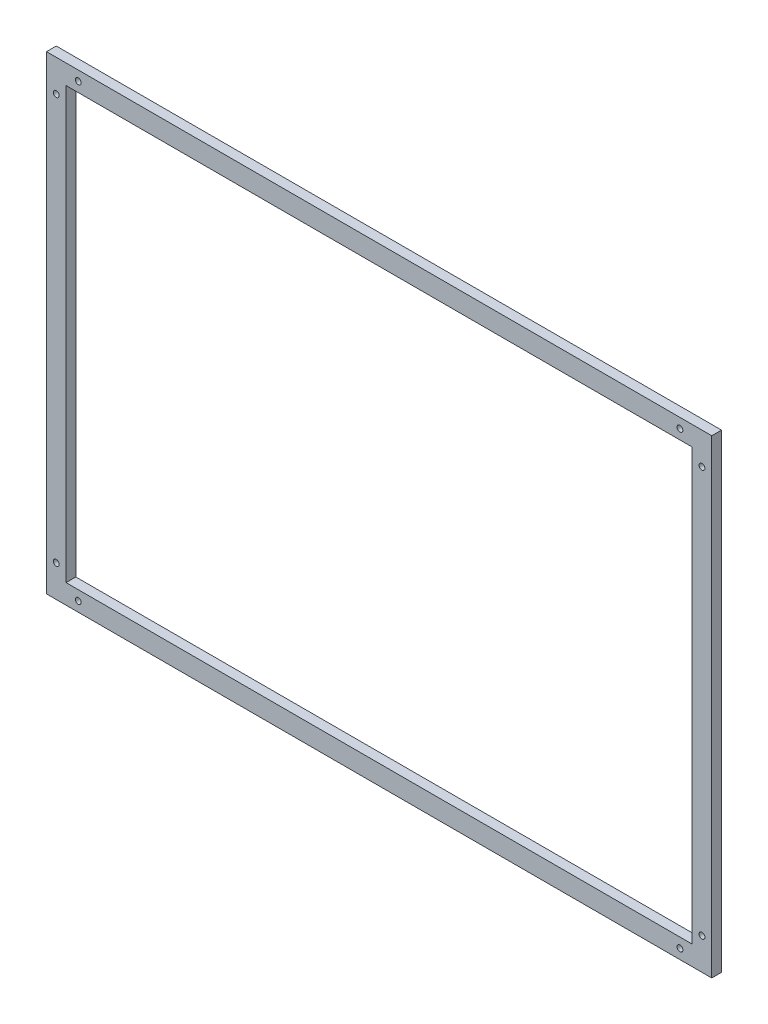
ISO-10303-21;
HEADER;
FILE_DESCRIPTION(('STEP AP214'),'2;1');
FILE_NAME('part.step','',(''),(''),'','','');
FILE_SCHEMA(('AUTOMOTIVE_DESIGN { 1 0 10303 214 1 1 1 1 }'));
ENDSEC;
DATA;
#1=APPLICATION_CONTEXT('core data for automotive mechanical design processes');
#2=APPLICATION_PROTOCOL_DEFINITION('international standard','automotive_design',2000,#1);
#3=PRODUCT_CONTEXT('',#1,'mechanical');
#4=PRODUCT('Part','Part','',(#3));
#5=PRODUCT_RELATED_PRODUCT_CATEGORY('part','',(#4));
#6=PRODUCT_DEFINITION_FORMATION('','',#4);
#7=PRODUCT_DEFINITION_CONTEXT('part definition',#1,'design');
#8=PRODUCT_DEFINITION('design','',#6,#7);
#9=PRODUCT_DEFINITION_SHAPE('','',#8);
#10=(LENGTH_UNIT() NAMED_UNIT(*) SI_UNIT(.MILLI.,.METRE.));
#11=(NAMED_UNIT(*) PLANE_ANGLE_UNIT() SI_UNIT($,.RADIAN.));
#12=(NAMED_UNIT(*) SI_UNIT($,.STERADIAN.) SOLID_ANGLE_UNIT());
#13=UNCERTAINTY_MEASURE_WITH_UNIT(LENGTH_MEASURE(1.E-05),#10,'distance_accuracy_value','');
#14=(GEOMETRIC_REPRESENTATION_CONTEXT(3) GLOBAL_UNCERTAINTY_ASSIGNED_CONTEXT((#13)) GLOBAL_UNIT_ASSIGNED_CONTEXT((#10,
#11,#12)) REPRESENTATION_CONTEXT('',''));
#15=CARTESIAN_POINT('',(0.,0.,0.));
#16=DIRECTION('',(0.,0.,1.));
#17=DIRECTION('',(1.,0.,0.));
#18=AXIS2_PLACEMENT_3D('',#15,#16,#17);
#19=CARTESIAN_POINT('',(0.,0.,10.));
#20=DIRECTION('',(0.,0.,1.));
#21=DIRECTION('',(1.,0.,0.));
#22=AXIS2_PLACEMENT_3D('',#19,#20,#21);
#23=PLANE('',#22);
#24=CARTESIAN_POINT('',(-10.,32.5,10.));
#25=DIRECTION('',(0.,0.,1.));
#26=DIRECTION('',(1.,0.,0.));
#27=AXIS2_PLACEMENT_3D('',#24,#25,#26);
#28=CIRCLE('',#27,3.);
#29=CARTESIAN_POINT('',(-7.,32.5,10.));
#30=VERTEX_POINT('',#29);
#31=EDGE_CURVE('E255',#30,#30,#28,.T.);
#32=ORIENTED_EDGE('',*,*,#31,.F.);
#33=EDGE_LOOP('',(#32));
#34=FACE_BOUND('',#33,.T.);
#35=CARTESIAN_POINT('',(-32.5,9.99999999999992,10.));
#36=DIRECTION('',(0.,0.,1.));
#37=DIRECTION('',(1.,0.,0.));
#38=AXIS2_PLACEMENT_3D('',#35,#36,#37);
#39=CIRCLE('',#38,3.);
#40=CARTESIAN_POINT('',(-29.5,9.99999999999992,10.));
#41=VERTEX_POINT('',#40);
#42=EDGE_CURVE('E257',#41,#41,#39,.T.);
#43=ORIENTED_EDGE('',*,*,#42,.F.);
#44=EDGE_LOOP('',(#43));
#45=FACE_BOUND('',#44,.T.);
#46=CARTESIAN_POINT('',(-647.5,9.9999999999999,10.));
#47=DIRECTION('',(0.,0.,1.));
#48=DIRECTION('',(1.,0.,0.));
#49=AXIS2_PLACEMENT_3D('',#46,#47,#48);
#50=CIRCLE('',#49,3.00000000000005);
#51=CARTESIAN_POINT('',(-644.5,9.9999999999999,10.));
#52=VERTEX_POINT('',#51);
#53=EDGE_CURVE('E263',#52,#52,#50,.T.);
#54=ORIENTED_EDGE('',*,*,#53,.F.);
#55=EDGE_LOOP('',(#54));
#56=FACE_BOUND('',#55,.T.);
#57=CARTESIAN_POINT('',(-670.,32.5,10.));
#58=DIRECTION('',(0.,0.,1.));
#59=DIRECTION('',(1.,0.,0.));
#60=AXIS2_PLACEMENT_3D('',#57,#58,#59);
#61=CIRCLE('',#60,3.00000000000005);
#62=CARTESIAN_POINT('',(-667.,32.5,10.));
#63=VERTEX_POINT('',#62);
#64=EDGE_CURVE('E269',#63,#63,#61,.T.);
#65=ORIENTED_EDGE('',*,*,#64,.F.);
#66=EDGE_LOOP('',(#65));
#67=FACE_BOUND('',#66,.T.);
#68=CARTESIAN_POINT('',(-670.,447.5,10.));
#69=DIRECTION('',(0.,0.,1.));
#70=DIRECTION('',(1.,0.,0.));
#71=AXIS2_PLACEMENT_3D('',#68,#69,#70);
#72=CIRCLE('',#71,3.00000000000005);
#73=CARTESIAN_POINT('',(-667.,447.5,10.));
#74=VERTEX_POINT('',#73);
#75=EDGE_CURVE('E275',#74,#74,#72,.T.);
#76=ORIENTED_EDGE('',*,*,#75,.F.);
#77=EDGE_LOOP('',(#76));
#78=FACE_BOUND('',#77,.T.);
#79=CARTESIAN_POINT('',(-647.5,470.,10.));
#80=DIRECTION('',(0.,0.,1.));
#81=DIRECTION('',(1.,0.,0.));
#82=AXIS2_PLACEMENT_3D('',#79,#80,#81);
#83=CIRCLE('',#82,3.00000000000005);
#84=CARTESIAN_POINT('',(-644.5,470.,10.));
#85=VERTEX_POINT('',#84);
#86=EDGE_CURVE('E281',#85,#85,#83,.T.);
#87=ORIENTED_EDGE('',*,*,#86,.F.);
#88=EDGE_LOOP('',(#87));
#89=FACE_BOUND('',#88,.T.);
#90=CARTESIAN_POINT('',(-10.,447.5,10.));
#91=DIRECTION('',(0.,0.,1.));
#92=DIRECTION('',(1.,0.,0.));
#93=AXIS2_PLACEMENT_3D('',#90,#91,#92);
#94=CIRCLE('',#93,3.);
#95=CARTESIAN_POINT('',(-7.,447.5,10.));
#96=VERTEX_POINT('',#95);
#97=EDGE_CURVE('E287',#96,#96,#94,.T.);
#98=ORIENTED_EDGE('',*,*,#97,.F.);
#99=EDGE_LOOP('',(#98));
#100=FACE_BOUND('',#99,.T.);
#101=CARTESIAN_POINT('',(-32.5,470.,10.));
#102=DIRECTION('',(0.,0.,1.));
#103=DIRECTION('',(1.,0.,0.));
#104=AXIS2_PLACEMENT_3D('',#101,#102,#103);
#105=CIRCLE('',#104,3.);
#106=CARTESIAN_POINT('',(-29.5,470.,10.));
#107=VERTEX_POINT('',#106);
#108=EDGE_CURVE('E293',#107,#107,#105,.T.);
#109=ORIENTED_EDGE('',*,*,#108,.F.);
#110=EDGE_LOOP('',(#109));
#111=FACE_BOUND('',#110,.T.);
#112=DIRECTION('',(0.,1.,0.));
#113=VECTOR('',#112,1.);
#114=CARTESIAN_POINT('',(0.,0.,10.));
#115=LINE('',#114,#113);
#116=CARTESIAN_POINT('',(0.,0.,10.));
#117=VERTEX_POINT('',#116);
#118=CARTESIAN_POINT('',(0.,480.,10.));
#119=VERTEX_POINT('',#118);
#120=EDGE_CURVE('E136',#117,#119,#115,.T.);
#121=ORIENTED_EDGE('',*,*,#120,.T.);
#122=DIRECTION('',(-1.,0.,0.));
#123=VECTOR('',#122,1.);
#124=CARTESIAN_POINT('',(0.,480.,10.));
#125=LINE('',#124,#123);
#126=CARTESIAN_POINT('',(-680.,480.,10.));
#127=VERTEX_POINT('',#126);
#128=EDGE_CURVE('E139',#119,#127,#125,.T.);
#129=ORIENTED_EDGE('',*,*,#128,.T.);
#130=DIRECTION('',(0.,-1.,0.));
#131=VECTOR('',#130,1.);
#132=CARTESIAN_POINT('',(-680.,0.,10.));
#133=LINE('',#132,#131);
#134=CARTESIAN_POINT('',(-680.,0.,10.));
#135=VERTEX_POINT('',#134);
#136=EDGE_CURVE('E142',#127,#135,#133,.T.);
#137=ORIENTED_EDGE('',*,*,#136,.T.);
#138=DIRECTION('',(1.,0.,0.));
#139=VECTOR('',#138,1.);
#140=CARTESIAN_POINT('',(0.,0.,10.));
#141=LINE('',#140,#139);
#142=EDGE_CURVE('E144',#135,#117,#141,.T.);
#143=ORIENTED_EDGE('',*,*,#142,.T.);
#144=EDGE_LOOP('',(#121,#129,#137,#143));
#145=FACE_BOUND('',#144,.T.);
#146=DIRECTION('',(1.,0.,0.));
#147=VECTOR('',#146,1.);
#148=CARTESIAN_POINT('',(-660.,19.9999999999999,10.));
#149=LINE('',#148,#147);
#150=CARTESIAN_POINT('',(-660.,19.9999999999999,10.));
#151=VERTEX_POINT('',#150);
#152=CARTESIAN_POINT('',(-20.,19.9999999999999,10.));
#153=VERTEX_POINT('',#152);
#154=EDGE_CURVE('E106',#151,#153,#149,.T.);
#155=ORIENTED_EDGE('',*,*,#154,.F.);
#156=DIRECTION('',(0.,-1.,0.));
#157=VECTOR('',#156,1.);
#158=CARTESIAN_POINT('',(-660.,460.,10.));
#159=LINE('',#158,#157);
#160=CARTESIAN_POINT('',(-660.,460.,10.));
#161=VERTEX_POINT('',#160);
#162=EDGE_CURVE('E98',#161,#151,#159,.T.);
#163=ORIENTED_EDGE('',*,*,#162,.F.);
#164=DIRECTION('',(-1.,0.,0.));
#165=VECTOR('',#164,1.);
#166=CARTESIAN_POINT('',(-660.,460.,10.));
#167=LINE('',#166,#165);
#168=CARTESIAN_POINT('',(-20.,460.,10.));
#169=VERTEX_POINT('',#168);
#170=EDGE_CURVE('E120',#169,#161,#167,.T.);
#171=ORIENTED_EDGE('',*,*,#170,.F.);
#172=DIRECTION('',(0.,1.,0.));
#173=VECTOR('',#172,1.);
#174=CARTESIAN_POINT('',(-20.,460.,10.));
#175=LINE('',#174,#173);
#176=EDGE_CURVE('E118',#153,#169,#175,.T.);
#177=ORIENTED_EDGE('',*,*,#176,.F.);
#178=EDGE_LOOP('',(#155,#163,#171,#177));
#179=FACE_BOUND('',#178,.T.);
#180=ADVANCED_FACE('F33',(#34,#45,#56,#67,#78,#89,#100,#111,#145,#179),#23,.T.);
#181=CARTESIAN_POINT('',(0.,0.,0.));
#182=DIRECTION('',(0.,0.,1.));
#183=DIRECTION('',(1.,0.,0.));
#184=AXIS2_PLACEMENT_3D('',#181,#182,#183);
#185=PLANE('',#184);
#186=CARTESIAN_POINT('',(-10.,32.5,0.));
#187=DIRECTION('',(0.,0.,1.));
#188=DIRECTION('',(1.,0.,0.));
#189=AXIS2_PLACEMENT_3D('',#186,#187,#188);
#190=CIRCLE('',#189,3.);
#191=CARTESIAN_POINT('',(-7.,32.5,0.));
#192=VERTEX_POINT('',#191);
#193=EDGE_CURVE('E253',#192,#192,#190,.T.);
#194=ORIENTED_EDGE('',*,*,#193,.T.);
#195=EDGE_LOOP('',(#194));
#196=FACE_BOUND('',#195,.T.);
#197=CARTESIAN_POINT('',(-32.5,9.99999999999992,0.));
#198=DIRECTION('',(0.,0.,1.));
#199=DIRECTION('',(1.,0.,0.));
#200=AXIS2_PLACEMENT_3D('',#197,#198,#199);
#201=CIRCLE('',#200,3.);
#202=CARTESIAN_POINT('',(-29.5,9.99999999999992,0.));
#203=VERTEX_POINT('',#202);
#204=EDGE_CURVE('E260',#203,#203,#201,.T.);
#205=ORIENTED_EDGE('',*,*,#204,.T.);
#206=EDGE_LOOP('',(#205));
#207=FACE_BOUND('',#206,.T.);
#208=CARTESIAN_POINT('',(-647.5,9.9999999999999,0.));
#209=DIRECTION('',(0.,0.,1.));
#210=DIRECTION('',(1.,0.,0.));
#211=AXIS2_PLACEMENT_3D('',#208,#209,#210);
#212=CIRCLE('',#211,3.00000000000005);
#213=CARTESIAN_POINT('',(-644.5,9.9999999999999,0.));
#214=VERTEX_POINT('',#213);
#215=EDGE_CURVE('E266',#214,#214,#212,.T.);
#216=ORIENTED_EDGE('',*,*,#215,.T.);
#217=EDGE_LOOP('',(#216));
#218=FACE_BOUND('',#217,.T.);
#219=CARTESIAN_POINT('',(-670.,32.5,0.));
#220=DIRECTION('',(0.,0.,1.));
#221=DIRECTION('',(1.,0.,0.));
#222=AXIS2_PLACEMENT_3D('',#219,#220,#221);
#223=CIRCLE('',#222,3.00000000000005);
#224=CARTESIAN_POINT('',(-667.,32.5,0.));
#225=VERTEX_POINT('',#224);
#226=EDGE_CURVE('E272',#225,#225,#223,.T.);
#227=ORIENTED_EDGE('',*,*,#226,.T.);
#228=EDGE_LOOP('',(#227));
#229=FACE_BOUND('',#228,.T.);
#230=CARTESIAN_POINT('',(-670.,447.5,0.));
#231=DIRECTION('',(0.,0.,1.));
#232=DIRECTION('',(1.,0.,0.));
#233=AXIS2_PLACEMENT_3D('',#230,#231,#232);
#234=CIRCLE('',#233,3.00000000000005);
#235=CARTESIAN_POINT('',(-667.,447.5,0.));
#236=VERTEX_POINT('',#235);
#237=EDGE_CURVE('E278',#236,#236,#234,.T.);
#238=ORIENTED_EDGE('',*,*,#237,.T.);
#239=EDGE_LOOP('',(#238));
#240=FACE_BOUND('',#239,.T.);
#241=CARTESIAN_POINT('',(-647.5,470.,0.));
#242=DIRECTION('',(0.,0.,1.));
#243=DIRECTION('',(1.,0.,0.));
#244=AXIS2_PLACEMENT_3D('',#241,#242,#243);
#245=CIRCLE('',#244,3.00000000000005);
#246=CARTESIAN_POINT('',(-644.5,470.,0.));
#247=VERTEX_POINT('',#246);
#248=EDGE_CURVE('E284',#247,#247,#245,.T.);
#249=ORIENTED_EDGE('',*,*,#248,.T.);
#250=EDGE_LOOP('',(#249));
#251=FACE_BOUND('',#250,.T.);
#252=CARTESIAN_POINT('',(-10.,447.5,0.));
#253=DIRECTION('',(0.,0.,1.));
#254=DIRECTION('',(1.,0.,0.));
#255=AXIS2_PLACEMENT_3D('',#252,#253,#254);
#256=CIRCLE('',#255,3.);
#257=CARTESIAN_POINT('',(-7.,447.5,0.));
#258=VERTEX_POINT('',#257);
#259=EDGE_CURVE('E290',#258,#258,#256,.T.);
#260=ORIENTED_EDGE('',*,*,#259,.T.);
#261=EDGE_LOOP('',(#260));
#262=FACE_BOUND('',#261,.T.);
#263=CARTESIAN_POINT('',(-32.5,470.,0.));
#264=DIRECTION('',(0.,0.,1.));
#265=DIRECTION('',(1.,0.,0.));
#266=AXIS2_PLACEMENT_3D('',#263,#264,#265);
#267=CIRCLE('',#266,3.);
#268=CARTESIAN_POINT('',(-29.5,470.,0.));
#269=VERTEX_POINT('',#268);
#270=EDGE_CURVE('E126',#269,#269,#267,.T.);
#271=ORIENTED_EDGE('',*,*,#270,.T.);
#272=EDGE_LOOP('',(#271));
#273=FACE_BOUND('',#272,.T.);
#274=DIRECTION('',(0.,1.,0.));
#275=VECTOR('',#274,1.);
#276=CARTESIAN_POINT('',(0.,0.,0.));
#277=LINE('',#276,#275);
#278=CARTESIAN_POINT('',(0.,0.,0.));
#279=VERTEX_POINT('',#278);
#280=CARTESIAN_POINT('',(0.,480.,0.));
#281=VERTEX_POINT('',#280);
#282=EDGE_CURVE('E114',#279,#281,#277,.T.);
#283=ORIENTED_EDGE('',*,*,#282,.F.);
#284=DIRECTION('',(1.,0.,0.));
#285=VECTOR('',#284,1.);
#286=CARTESIAN_POINT('',(0.,0.,0.));
#287=LINE('',#286,#285);
#288=CARTESIAN_POINT('',(-680.,0.,0.));
#289=VERTEX_POINT('',#288);
#290=EDGE_CURVE('E140',#289,#279,#287,.T.);
#291=ORIENTED_EDGE('',*,*,#290,.F.);
#292=DIRECTION('',(0.,-1.,0.));
#293=VECTOR('',#292,1.);
#294=CARTESIAN_POINT('',(-680.,0.,0.));
#295=LINE('',#294,#293);
#296=CARTESIAN_POINT('',(-680.,480.,0.));
#297=VERTEX_POINT('',#296);
#298=EDGE_CURVE('E151',#297,#289,#295,.T.);
#299=ORIENTED_EDGE('',*,*,#298,.F.);
#300=DIRECTION('',(-1.,0.,0.));
#301=VECTOR('',#300,1.);
#302=CARTESIAN_POINT('',(0.,480.,0.));
#303=LINE('',#302,#301);
#304=EDGE_CURVE('E149',#281,#297,#303,.T.);
#305=ORIENTED_EDGE('',*,*,#304,.F.);
#306=EDGE_LOOP('',(#283,#291,#299,#305));
#307=FACE_BOUND('',#306,.T.);
#308=DIRECTION('',(0.,-1.,0.));
#309=VECTOR('',#308,1.);
#310=CARTESIAN_POINT('',(-660.,460.,0.));
#311=LINE('',#310,#309);
#312=CARTESIAN_POINT('',(-660.,460.,0.));
#313=VERTEX_POINT('',#312);
#314=CARTESIAN_POINT('',(-660.,19.9999999999999,0.));
#315=VERTEX_POINT('',#314);
#316=EDGE_CURVE('E56',#313,#315,#311,.T.);
#317=ORIENTED_EDGE('',*,*,#316,.T.);
#318=DIRECTION('',(1.,0.,0.));
#319=VECTOR('',#318,1.);
#320=CARTESIAN_POINT('',(-660.,19.9999999999999,0.));
#321=LINE('',#320,#319);
#322=CARTESIAN_POINT('',(-20.,19.9999999999999,0.));
#323=VERTEX_POINT('',#322);
#324=EDGE_CURVE('E113',#315,#323,#321,.T.);
#325=ORIENTED_EDGE('',*,*,#324,.T.);
#326=DIRECTION('',(0.,1.,0.));
#327=VECTOR('',#326,1.);
#328=CARTESIAN_POINT('',(-20.,460.,0.));
#329=LINE('',#328,#327);
#330=CARTESIAN_POINT('',(-20.,460.,0.));
#331=VERTEX_POINT('',#330);
#332=EDGE_CURVE('E128',#323,#331,#329,.T.);
#333=ORIENTED_EDGE('',*,*,#332,.T.);
#334=DIRECTION('',(-1.,0.,0.));
#335=VECTOR('',#334,1.);
#336=CARTESIAN_POINT('',(-660.,460.,0.));
#337=LINE('',#336,#335);
#338=EDGE_CURVE('E107',#331,#313,#337,.T.);
#339=ORIENTED_EDGE('',*,*,#338,.T.);
#340=EDGE_LOOP('',(#317,#325,#333,#339));
#341=FACE_BOUND('',#340,.T.);
#342=ADVANCED_FACE('F169',(#196,#207,#218,#229,#240,#251,#262,#273,#307,#341),#185,.F.);
#343=CARTESIAN_POINT('',(0.,0.,10.));
#344=DIRECTION('',(-1.,0.,0.));
#345=DIRECTION('',(0.,0.,1.));
#346=AXIS2_PLACEMENT_3D('',#343,#344,#345);
#347=PLANE('',#346);
#348=ORIENTED_EDGE('',*,*,#282,.T.);
#349=DIRECTION('',(0.,0.,-1.));
#350=VECTOR('',#349,1.);
#351=CARTESIAN_POINT('',(0.,480.,10.));
#352=LINE('',#351,#350);
#353=EDGE_CURVE('E11',#119,#281,#352,.T.);
#354=ORIENTED_EDGE('',*,*,#353,.F.);
#355=ORIENTED_EDGE('',*,*,#120,.F.);
#356=DIRECTION('',(0.,0.,-1.));
#357=VECTOR('',#356,1.);
#358=CARTESIAN_POINT('',(0.,0.,10.));
#359=LINE('',#358,#357);
#360=EDGE_CURVE('E146',#117,#279,#359,.T.);
#361=ORIENTED_EDGE('',*,*,#360,.T.);
#362=EDGE_LOOP('',(#348,#354,#355,#361));
#363=FACE_BOUND('',#362,.T.);
#364=ADVANCED_FACE('F35',(#363),#347,.F.);
#365=CARTESIAN_POINT('',(0.,480.,10.));
#366=DIRECTION('',(0.,-1.,0.));
#367=DIRECTION('',(1.,0.,0.));
#368=AXIS2_PLACEMENT_3D('',#365,#366,#367);
#369=PLANE('',#368);
#370=ORIENTED_EDGE('',*,*,#304,.T.);
#371=DIRECTION('',(0.,0.,-1.));
#372=VECTOR('',#371,1.);
#373=CARTESIAN_POINT('',(-680.,480.,10.));
#374=LINE('',#373,#372);
#375=EDGE_CURVE('E41',#127,#297,#374,.T.);
#376=ORIENTED_EDGE('',*,*,#375,.F.);
#377=ORIENTED_EDGE('',*,*,#128,.F.);
#378=ORIENTED_EDGE('',*,*,#353,.T.);
#379=EDGE_LOOP('',(#370,#376,#377,#378));
#380=FACE_BOUND('',#379,.T.);
#381=ADVANCED_FACE('F179',(#380),#369,.F.);
#382=CARTESIAN_POINT('',(-680.,0.,10.));
#383=DIRECTION('',(1.,0.,0.));
#384=DIRECTION('',(0.,0.,-1.));
#385=AXIS2_PLACEMENT_3D('',#382,#383,#384);
#386=PLANE('',#385);
#387=ORIENTED_EDGE('',*,*,#298,.T.);
#388=DIRECTION('',(0.,0.,-1.));
#389=VECTOR('',#388,1.);
#390=CARTESIAN_POINT('',(-680.,0.,10.));
#391=LINE('',#390,#389);
#392=EDGE_CURVE('E156',#135,#289,#391,.T.);
#393=ORIENTED_EDGE('',*,*,#392,.F.);
#394=ORIENTED_EDGE('',*,*,#136,.F.);
#395=ORIENTED_EDGE('',*,*,#375,.T.);
#396=EDGE_LOOP('',(#387,#393,#394,#395));
#397=FACE_BOUND('',#396,.T.);
#398=ADVANCED_FACE('F163',(#397),#386,.F.);
#399=CARTESIAN_POINT('',(0.,0.,10.));
#400=DIRECTION('',(0.,1.,0.));
#401=DIRECTION('',(0.,0.,1.));
#402=AXIS2_PLACEMENT_3D('',#399,#400,#401);
#403=PLANE('',#402);
#404=ORIENTED_EDGE('',*,*,#290,.T.);
#405=ORIENTED_EDGE('',*,*,#360,.F.);
#406=ORIENTED_EDGE('',*,*,#142,.F.);
#407=ORIENTED_EDGE('',*,*,#392,.T.);
#408=EDGE_LOOP('',(#404,#405,#406,#407));
#409=FACE_BOUND('',#408,.T.);
#410=ADVANCED_FACE('F173',(#409),#403,.F.);
#411=CARTESIAN_POINT('',(-660.,460.,10.));
#412=DIRECTION('',(1.,0.,0.));
#413=DIRECTION('',(0.,0.,-1.));
#414=AXIS2_PLACEMENT_3D('',#411,#412,#413);
#415=PLANE('',#414);
#416=ORIENTED_EDGE('',*,*,#316,.F.);
#417=DIRECTION('',(0.,0.,-1.));
#418=VECTOR('',#417,1.);
#419=CARTESIAN_POINT('',(-660.,460.,10.));
#420=LINE('',#419,#418);
#421=EDGE_CURVE('E102',#161,#313,#420,.T.);
#422=ORIENTED_EDGE('',*,*,#421,.F.);
#423=ORIENTED_EDGE('',*,*,#162,.T.);
#424=DIRECTION('',(0.,0.,-1.));
#425=VECTOR('',#424,1.);
#426=CARTESIAN_POINT('',(-660.,19.9999999999999,10.));
#427=LINE('',#426,#425);
#428=EDGE_CURVE('E101',#151,#315,#427,.T.);
#429=ORIENTED_EDGE('',*,*,#428,.T.);
#430=EDGE_LOOP('',(#416,#422,#423,#429));
#431=FACE_BOUND('',#430,.T.);
#432=ADVANCED_FACE('F100',(#431),#415,.T.);
#433=CARTESIAN_POINT('',(-660.,19.9999999999999,10.));
#434=DIRECTION('',(0.,1.,0.));
#435=DIRECTION('',(0.,0.,1.));
#436=AXIS2_PLACEMENT_3D('',#433,#434,#435);
#437=PLANE('',#436);
#438=ORIENTED_EDGE('',*,*,#324,.F.);
#439=ORIENTED_EDGE('',*,*,#428,.F.);
#440=ORIENTED_EDGE('',*,*,#154,.T.);
#441=DIRECTION('',(0.,0.,-1.));
#442=VECTOR('',#441,1.);
#443=CARTESIAN_POINT('',(-20.,19.9999999999999,10.));
#444=LINE('',#443,#442);
#445=EDGE_CURVE('E115',#153,#323,#444,.T.);
#446=ORIENTED_EDGE('',*,*,#445,.T.);
#447=EDGE_LOOP('',(#438,#439,#440,#446));
#448=FACE_BOUND('',#447,.T.);
#449=ADVANCED_FACE('F110',(#448),#437,.T.);
#450=CARTESIAN_POINT('',(-20.,460.,10.));
#451=DIRECTION('',(-1.,0.,0.));
#452=DIRECTION('',(0.,0.,1.));
#453=AXIS2_PLACEMENT_3D('',#450,#451,#452);
#454=PLANE('',#453);
#455=ORIENTED_EDGE('',*,*,#332,.F.);
#456=ORIENTED_EDGE('',*,*,#445,.F.);
#457=ORIENTED_EDGE('',*,*,#176,.T.);
#458=DIRECTION('',(0.,0.,-1.));
#459=VECTOR('',#458,1.);
#460=CARTESIAN_POINT('',(-20.,460.,10.));
#461=LINE('',#460,#459);
#462=EDGE_CURVE('E48',#169,#331,#461,.T.);
#463=ORIENTED_EDGE('',*,*,#462,.T.);
#464=EDGE_LOOP('',(#455,#456,#457,#463));
#465=FACE_BOUND('',#464,.T.);
#466=ADVANCED_FACE('F207',(#465),#454,.T.);
#467=CARTESIAN_POINT('',(-660.,460.,10.));
#468=DIRECTION('',(0.,-1.,0.));
#469=DIRECTION('',(0.,0.,-1.));
#470=AXIS2_PLACEMENT_3D('',#467,#468,#469);
#471=PLANE('',#470);
#472=ORIENTED_EDGE('',*,*,#338,.F.);
#473=ORIENTED_EDGE('',*,*,#462,.F.);
#474=ORIENTED_EDGE('',*,*,#170,.T.);
#475=ORIENTED_EDGE('',*,*,#421,.T.);
#476=EDGE_LOOP('',(#472,#473,#474,#475));
#477=FACE_BOUND('',#476,.T.);
#478=ADVANCED_FACE('F211',(#477),#471,.T.);
#479=CARTESIAN_POINT('',(-32.5,470.,0.));
#480=DIRECTION('',(0.,0.,1.));
#481=DIRECTION('',(1.,0.,0.));
#482=AXIS2_PLACEMENT_3D('',#479,#480,#481);
#483=CYLINDRICAL_SURFACE('',#482,3.);
#484=ORIENTED_EDGE('',*,*,#270,.F.);
#485=EDGE_LOOP('',(#484));
#486=FACE_BOUND('',#485,.T.);
#487=ORIENTED_EDGE('',*,*,#108,.T.);
#488=EDGE_LOOP('',(#487));
#489=FACE_BOUND('',#488,.T.);
#490=ADVANCED_FACE('F217',(#486,#489),#483,.F.);
#491=CARTESIAN_POINT('',(-10.,447.5,0.));
#492=DIRECTION('',(0.,0.,1.));
#493=DIRECTION('',(1.,0.,0.));
#494=AXIS2_PLACEMENT_3D('',#491,#492,#493);
#495=CYLINDRICAL_SURFACE('',#494,3.);
#496=ORIENTED_EDGE('',*,*,#259,.F.);
#497=EDGE_LOOP('',(#496));
#498=FACE_BOUND('',#497,.T.);
#499=ORIENTED_EDGE('',*,*,#97,.T.);
#500=EDGE_LOOP('',(#499));
#501=FACE_BOUND('',#500,.T.);
#502=ADVANCED_FACE('F220',(#498,#501),#495,.F.);
#503=CARTESIAN_POINT('',(-647.5,470.,0.));
#504=DIRECTION('',(0.,0.,1.));
#505=DIRECTION('',(1.,0.,0.));
#506=AXIS2_PLACEMENT_3D('',#503,#504,#505);
#507=CYLINDRICAL_SURFACE('',#506,3.00000000000005);
#508=ORIENTED_EDGE('',*,*,#248,.F.);
#509=EDGE_LOOP('',(#508));
#510=FACE_BOUND('',#509,.T.);
#511=ORIENTED_EDGE('',*,*,#86,.T.);
#512=EDGE_LOOP('',(#511));
#513=FACE_BOUND('',#512,.T.);
#514=ADVANCED_FACE('F224',(#510,#513),#507,.F.);
#515=CARTESIAN_POINT('',(-670.,447.5,0.));
#516=DIRECTION('',(0.,0.,1.));
#517=DIRECTION('',(1.,0.,0.));
#518=AXIS2_PLACEMENT_3D('',#515,#516,#517);
#519=CYLINDRICAL_SURFACE('',#518,3.00000000000005);
#520=ORIENTED_EDGE('',*,*,#237,.F.);
#521=EDGE_LOOP('',(#520));
#522=FACE_BOUND('',#521,.T.);
#523=ORIENTED_EDGE('',*,*,#75,.T.);
#524=EDGE_LOOP('',(#523));
#525=FACE_BOUND('',#524,.T.);
#526=ADVANCED_FACE('F228',(#522,#525),#519,.F.);
#527=CARTESIAN_POINT('',(-670.,32.5,0.));
#528=DIRECTION('',(0.,0.,1.));
#529=DIRECTION('',(1.,0.,0.));
#530=AXIS2_PLACEMENT_3D('',#527,#528,#529);
#531=CYLINDRICAL_SURFACE('',#530,3.00000000000005);
#532=ORIENTED_EDGE('',*,*,#226,.F.);
#533=EDGE_LOOP('',(#532));
#534=FACE_BOUND('',#533,.T.);
#535=ORIENTED_EDGE('',*,*,#64,.T.);
#536=EDGE_LOOP('',(#535));
#537=FACE_BOUND('',#536,.T.);
#538=ADVANCED_FACE('F232',(#534,#537),#531,.F.);
#539=CARTESIAN_POINT('',(-647.5,9.9999999999999,0.));
#540=DIRECTION('',(0.,0.,1.));
#541=DIRECTION('',(1.,0.,0.));
#542=AXIS2_PLACEMENT_3D('',#539,#540,#541);
#543=CYLINDRICAL_SURFACE('',#542,3.00000000000005);
#544=ORIENTED_EDGE('',*,*,#215,.F.);
#545=EDGE_LOOP('',(#544));
#546=FACE_BOUND('',#545,.T.);
#547=ORIENTED_EDGE('',*,*,#53,.T.);
#548=EDGE_LOOP('',(#547));
#549=FACE_BOUND('',#548,.T.);
#550=ADVANCED_FACE('F236',(#546,#549),#543,.F.);
#551=CARTESIAN_POINT('',(-32.5,9.99999999999992,0.));
#552=DIRECTION('',(0.,0.,1.));
#553=DIRECTION('',(1.,0.,0.));
#554=AXIS2_PLACEMENT_3D('',#551,#552,#553);
#555=CYLINDRICAL_SURFACE('',#554,3.);
#556=ORIENTED_EDGE('',*,*,#204,.F.);
#557=EDGE_LOOP('',(#556));
#558=FACE_BOUND('',#557,.T.);
#559=ORIENTED_EDGE('',*,*,#42,.T.);
#560=EDGE_LOOP('',(#559));
#561=FACE_BOUND('',#560,.T.);
#562=ADVANCED_FACE('F240',(#558,#561),#555,.F.);
#563=CARTESIAN_POINT('',(-10.,32.5,0.));
#564=DIRECTION('',(0.,0.,1.));
#565=DIRECTION('',(1.,0.,0.));
#566=AXIS2_PLACEMENT_3D('',#563,#564,#565);
#567=CYLINDRICAL_SURFACE('',#566,3.);
#568=ORIENTED_EDGE('',*,*,#193,.F.);
#569=EDGE_LOOP('',(#568));
#570=FACE_BOUND('',#569,.T.);
#571=ORIENTED_EDGE('',*,*,#31,.T.);
#572=EDGE_LOOP('',(#571));
#573=FACE_BOUND('',#572,.T.);
#574=ADVANCED_FACE('F244',(#570,#573),#567,.F.);
#575=CLOSED_SHELL('',(#180,#342,#364,#381,#398,#410,#432,#449,#466,#478,#490,#502,#514,#526,
#538,#550,#562,#574));
#576=MANIFOLD_SOLID_BREP('B2',#575);
#577=ADVANCED_BREP_SHAPE_REPRESENTATION('',(#18,#576),#14);
#578=SHAPE_DEFINITION_REPRESENTATION(#9,#577);
ENDSEC;
END-ISO-10303-21;
